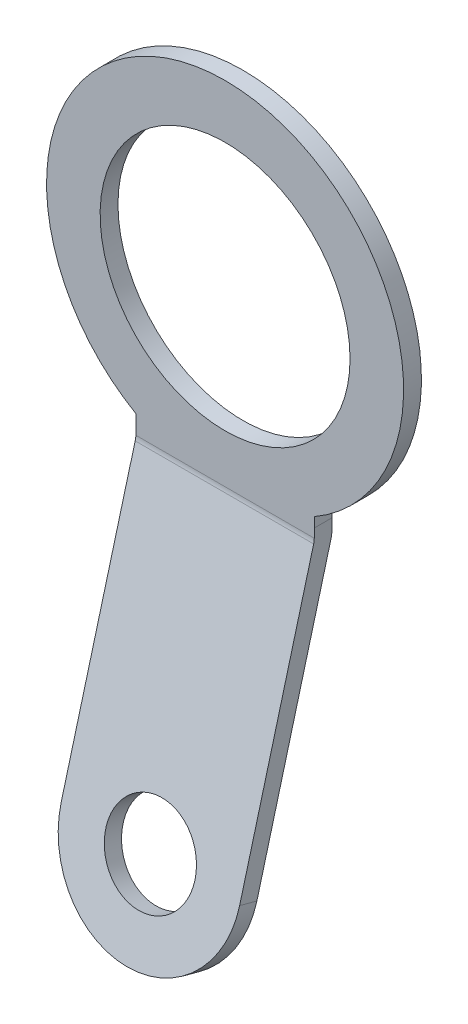
ISO-10303-21;
HEADER;
FILE_DESCRIPTION(('STEP AP214'),'2;1');
FILE_NAME('part.step','',(''),(''),'','','');
FILE_SCHEMA(('AUTOMOTIVE_DESIGN { 1 0 10303 214 1 1 1 1 }'));
ENDSEC;
DATA;
#1=APPLICATION_CONTEXT('core data for automotive mechanical design processes');
#2=APPLICATION_PROTOCOL_DEFINITION('international standard','automotive_design',2000,#1);
#3=PRODUCT_CONTEXT('',#1,'mechanical');
#4=PRODUCT('Part','Part','',(#3));
#5=PRODUCT_RELATED_PRODUCT_CATEGORY('part','',(#4));
#6=PRODUCT_DEFINITION_FORMATION('','',#4);
#7=PRODUCT_DEFINITION_CONTEXT('part definition',#1,'design');
#8=PRODUCT_DEFINITION('design','',#6,#7);
#9=PRODUCT_DEFINITION_SHAPE('','',#8);
#10=(LENGTH_UNIT() NAMED_UNIT(*) SI_UNIT(.MILLI.,.METRE.));
#11=(NAMED_UNIT(*) PLANE_ANGLE_UNIT() SI_UNIT($,.RADIAN.));
#12=(NAMED_UNIT(*) SI_UNIT($,.STERADIAN.) SOLID_ANGLE_UNIT());
#13=UNCERTAINTY_MEASURE_WITH_UNIT(LENGTH_MEASURE(1.E-05),#10,'distance_accuracy_value','');
#14=(GEOMETRIC_REPRESENTATION_CONTEXT(3) GLOBAL_UNCERTAINTY_ASSIGNED_CONTEXT((#13)) GLOBAL_UNIT_ASSIGNED_CONTEXT((#10,
#11,#12)) REPRESENTATION_CONTEXT('',''));
#15=CARTESIAN_POINT('',(0.,0.,0.));
#16=DIRECTION('',(0.,0.,1.));
#17=DIRECTION('',(1.,0.,0.));
#18=AXIS2_PLACEMENT_3D('',#15,#16,#17);
#19=CARTESIAN_POINT('',(0.99918015483103,-1.94233508480034,0.1));
#20=DIRECTION('',(1.,0.,0.));
#21=DIRECTION('',(0.,1.,0.));
#22=AXIS2_PLACEMENT_3D('',#19,#20,#21);
#23=PLANE('',#22);
#24=CARTESIAN_POINT('',(0.99918015483103,-1.94233508480034,0.4));
#25=DIRECTION('',(-1.,0.,0.));
#26=DIRECTION('',(0.,1.,0.));
#27=AXIS2_PLACEMENT_3D('',#24,#25,#26);
#28=CIRCLE('',#27,0.2);
#29=CARTESIAN_POINT('',(0.99918015483103,-1.94233508480034,0.2));
#30=VERTEX_POINT('',#29);
#31=CARTESIAN_POINT('',(0.99918015483103,-1.99409889382085,0.206814834742186));
#32=VERTEX_POINT('',#31);
#33=EDGE_CURVE('E10',#30,#32,#28,.T.);
#34=ORIENTED_EDGE('',*,*,#33,.T.);
#35=DIRECTION('',(0.,-0.965925826289068,0.258819045102521));
#36=VECTOR('',#35,1.);
#37=CARTESIAN_POINT('',(0.999180154831032,-5.08876600205175,1.03602838723581));
#38=LINE('',#37,#36);
#39=CARTESIAN_POINT('',(0.999180154831032,-5.08876600205175,1.03602838723581));
#40=VERTEX_POINT('',#39);
#41=EDGE_CURVE('E130',#32,#40,#38,.T.);
#42=ORIENTED_EDGE('',*,*,#41,.T.);
#43=DIRECTION('',(0.,0.258819045102521,0.965925826289068));
#44=VECTOR('',#43,1.);
#45=CARTESIAN_POINT('',(0.999180154831032,-5.14052981107225,0.842843221977999));
#46=LINE('',#45,#44);
#47=CARTESIAN_POINT('',(0.999180154831032,-5.14052981107225,0.842843221977999));
#48=VERTEX_POINT('',#47);
#49=EDGE_CURVE('E120',#48,#40,#46,.T.);
#50=ORIENTED_EDGE('',*,*,#49,.F.);
#51=DIRECTION('',(0.,0.965925826289068,-0.258819045102521));
#52=VECTOR('',#51,1.);
#53=CARTESIAN_POINT('',(0.999180154831032,-5.14052981107225,0.842843221977999));
#54=LINE('',#53,#52);
#55=CARTESIAN_POINT('',(0.99918015483103,-2.04586270284135,0.0136296694843726));
#56=VERTEX_POINT('',#55);
#57=EDGE_CURVE('E119',#48,#56,#54,.T.);
#58=ORIENTED_EDGE('',*,*,#57,.T.);
#59=CARTESIAN_POINT('',(0.99918015483103,-1.94233508480034,0.4));
#60=DIRECTION('',(-1.,0.,0.));
#61=DIRECTION('',(0.,1.,0.));
#62=AXIS2_PLACEMENT_3D('',#59,#60,#61);
#63=CIRCLE('',#62,0.4);
#64=CARTESIAN_POINT('',(0.99918015483103,-1.94233508480034,0.));
#65=VERTEX_POINT('',#64);
#66=EDGE_CURVE('E26',#65,#56,#63,.T.);
#67=ORIENTED_EDGE('',*,*,#66,.F.);
#68=DIRECTION('',(0.,-1.,0.));
#69=VECTOR('',#68,1.);
#70=CARTESIAN_POINT('',(0.99918015483103,-1.03911021004055,0.));
#71=LINE('',#70,#69);
#72=CARTESIAN_POINT('',(0.99918015483103,-1.84233508480034,0.));
#73=VERTEX_POINT('',#72);
#74=EDGE_CURVE('E194',#73,#65,#71,.T.);
#75=ORIENTED_EDGE('',*,*,#74,.F.);
#76=DIRECTION('',(0.,0.,-1.));
#77=VECTOR('',#76,1.);
#78=CARTESIAN_POINT('',(0.99918015483103,-1.84233508480034,0.2));
#79=LINE('',#78,#77);
#80=CARTESIAN_POINT('',(0.99918015483103,-1.84233508480034,0.2));
#81=VERTEX_POINT('',#80);
#82=EDGE_CURVE('E191',#81,#73,#79,.T.);
#83=ORIENTED_EDGE('',*,*,#82,.F.);
#84=DIRECTION('',(0.,1.,0.));
#85=VECTOR('',#84,1.);
#86=CARTESIAN_POINT('',(0.99918015483103,-1.03911021004055,0.2));
#87=LINE('',#86,#85);
#88=EDGE_CURVE('E162',#30,#81,#87,.T.);
#89=ORIENTED_EDGE('',*,*,#88,.F.);
#90=EDGE_LOOP('',(#34,#42,#50,#58,#67,#75,#83,#89));
#91=FACE_BOUND('',#90,.T.);
#92=ADVANCED_FACE('F16',(#91),#23,.T.);
#93=CARTESIAN_POINT('',(-0.000409922584484745,-1.94233508480034,0.4));
#94=DIRECTION('',(-1.,0.,0.));
#95=DIRECTION('',(0.,1.,0.));
#96=AXIS2_PLACEMENT_3D('',#93,#94,#95);
#97=CYLINDRICAL_SURFACE('',#96,0.4);
#98=DIRECTION('',(1.,0.,0.));
#99=VECTOR('',#98,1.);
#100=CARTESIAN_POINT('',(0.999180154831031,-2.04586270284135,0.0136296694843725));
#101=LINE('',#100,#99);
#102=CARTESIAN_POINT('',(-1.,-2.04586270284135,0.0136296694843726));
#103=VERTEX_POINT('',#102);
#104=EDGE_CURVE('E35',#103,#56,#101,.T.);
#105=ORIENTED_EDGE('',*,*,#104,.F.);
#106=CARTESIAN_POINT('',(-1.,-1.94233508480034,0.4));
#107=DIRECTION('',(-1.,0.,0.));
#108=DIRECTION('',(0.,1.,0.));
#109=AXIS2_PLACEMENT_3D('',#106,#107,#108);
#110=CIRCLE('',#109,0.4);
#111=CARTESIAN_POINT('',(-1.,-1.94233508480034,0.));
#112=VERTEX_POINT('',#111);
#113=EDGE_CURVE('E205',#112,#103,#110,.T.);
#114=ORIENTED_EDGE('',*,*,#113,.F.);
#115=DIRECTION('',(-1.,0.,0.));
#116=VECTOR('',#115,1.);
#117=CARTESIAN_POINT('',(-0.5,-1.94233508480034,0.));
#118=LINE('',#117,#116);
#119=EDGE_CURVE('E169',#65,#112,#118,.T.);
#120=ORIENTED_EDGE('',*,*,#119,.F.);
#121=ORIENTED_EDGE('',*,*,#66,.T.);
#122=EDGE_LOOP('',(#105,#114,#120,#121));
#123=FACE_BOUND('',#122,.T.);
#124=ADVANCED_FACE('F212',(#123),#97,.T.);
#125=CARTESIAN_POINT('',(-1.,-1.94233508480034,0.1));
#126=DIRECTION('',(-1.,0.,0.));
#127=DIRECTION('',(0.,-1.,0.));
#128=AXIS2_PLACEMENT_3D('',#125,#126,#127);
#129=PLANE('',#128);
#130=ORIENTED_EDGE('',*,*,#113,.T.);
#131=DIRECTION('',(0.,0.965925826289068,-0.258819045102521));
#132=VECTOR('',#131,1.);
#133=CARTESIAN_POINT('',(-1.,-2.23791892034897,0.0650909778669154));
#134=LINE('',#133,#132);
#135=CARTESIAN_POINT('',(-1.,-2.23791892034897,0.0650909778669154));
#136=VERTEX_POINT('',#135);
#137=EDGE_CURVE('E143',#136,#103,#134,.T.);
#138=ORIENTED_EDGE('',*,*,#137,.F.);
#139=DIRECTION('',(0.,-0.258819045102521,-0.965925826289068));
#140=VECTOR('',#139,1.);
#141=CARTESIAN_POINT('',(-1.,-2.21203701583872,0.161683560495822));
#142=LINE('',#141,#140);
#143=CARTESIAN_POINT('',(-1.,-2.18615511132847,0.258276143124729));
#144=VERTEX_POINT('',#143);
#145=EDGE_CURVE('E140',#144,#136,#142,.T.);
#146=ORIENTED_EDGE('',*,*,#145,.F.);
#147=DIRECTION('',(0.,0.965925826289068,-0.258819045102521));
#148=VECTOR('',#147,1.);
#149=CARTESIAN_POINT('',(-1.,-2.18615511132847,0.258276143124729));
#150=LINE('',#149,#148);
#151=CARTESIAN_POINT('',(-1.,-1.99409889382085,0.206814834742186));
#152=VERTEX_POINT('',#151);
#153=EDGE_CURVE('E148',#144,#152,#150,.T.);
#154=ORIENTED_EDGE('',*,*,#153,.T.);
#155=CARTESIAN_POINT('',(-1.,-1.94233508480034,0.4));
#156=DIRECTION('',(-1.,0.,0.));
#157=DIRECTION('',(0.,1.,0.));
#158=AXIS2_PLACEMENT_3D('',#155,#156,#157);
#159=CIRCLE('',#158,0.2);
#160=CARTESIAN_POINT('',(-1.,-1.94233508480034,0.2));
#161=VERTEX_POINT('',#160);
#162=EDGE_CURVE('E198',#161,#152,#159,.T.);
#163=ORIENTED_EDGE('',*,*,#162,.F.);
#164=DIRECTION('',(0.,1.,0.));
#165=VECTOR('',#164,1.);
#166=CARTESIAN_POINT('',(-1.,-1.73205080756888,0.2));
#167=LINE('',#166,#165);
#168=CARTESIAN_POINT('',(-1.,-1.73205080756888,0.2));
#169=VERTEX_POINT('',#168);
#170=EDGE_CURVE('E166',#161,#169,#167,.T.);
#171=ORIENTED_EDGE('',*,*,#170,.T.);
#172=DIRECTION('',(0.,0.,1.));
#173=VECTOR('',#172,1.);
#174=CARTESIAN_POINT('',(-1.,-1.73205080756888,0.));
#175=LINE('',#174,#173);
#176=CARTESIAN_POINT('',(-1.,-1.73205080756888,0.));
#177=VERTEX_POINT('',#176);
#178=EDGE_CURVE('E163',#177,#169,#175,.T.);
#179=ORIENTED_EDGE('',*,*,#178,.F.);
#180=DIRECTION('',(0.,-1.,0.));
#181=VECTOR('',#180,1.);
#182=CARTESIAN_POINT('',(-1.,-1.73205080756888,0.));
#183=LINE('',#182,#181);
#184=EDGE_CURVE('E158',#177,#112,#183,.T.);
#185=ORIENTED_EDGE('',*,*,#184,.T.);
#186=EDGE_LOOP('',(#130,#138,#146,#154,#163,#171,#179,#185));
#187=FACE_BOUND('',#186,.T.);
#188=ADVANCED_FACE('F224',(#187),#129,.T.);
#189=CARTESIAN_POINT('',(-0.000409922584484745,-1.94233508480034,0.4));
#190=DIRECTION('',(-1.,0.,0.));
#191=DIRECTION('',(0.,1.,0.));
#192=AXIS2_PLACEMENT_3D('',#189,#190,#191);
#193=CYLINDRICAL_SURFACE('',#192,0.2);
#194=DIRECTION('',(-1.,0.,0.));
#195=VECTOR('',#194,1.);
#196=CARTESIAN_POINT('',(-1.,-1.99409889382085,0.206814834742186));
#197=LINE('',#196,#195);
#198=EDGE_CURVE('E147',#32,#152,#197,.T.);
#199=ORIENTED_EDGE('',*,*,#198,.F.);
#200=ORIENTED_EDGE('',*,*,#33,.F.);
#201=DIRECTION('',(1.,0.,0.));
#202=VECTOR('',#201,1.);
#203=CARTESIAN_POINT('',(-0.5,-1.94233508480034,0.2));
#204=LINE('',#203,#202);
#205=EDGE_CURVE('E188',#161,#30,#204,.T.);
#206=ORIENTED_EDGE('',*,*,#205,.F.);
#207=ORIENTED_EDGE('',*,*,#162,.T.);
#208=EDGE_LOOP('',(#199,#200,#206,#207));
#209=FACE_BOUND('',#208,.T.);
#210=ADVANCED_FACE('F243',(#209),#193,.F.);
#211=CARTESIAN_POINT('',(1.,-1.84233508480034,0.2));
#212=DIRECTION('',(0.,1.,0.));
#213=DIRECTION('',(0.,0.,1.));
#214=AXIS2_PLACEMENT_3D('',#211,#212,#213);
#215=PLANE('',#214);
#216=DIRECTION('',(-1.,0.,0.));
#217=VECTOR('',#216,1.);
#218=CARTESIAN_POINT('',(0.5,-1.84233508480034,0.));
#219=LINE('',#218,#217);
#220=CARTESIAN_POINT('',(1.,-1.84233508480034,0.));
#221=VERTEX_POINT('',#220);
#222=EDGE_CURVE('E177',#221,#73,#219,.T.);
#223=ORIENTED_EDGE('',*,*,#222,.F.);
#224=DIRECTION('',(0.,0.,-1.));
#225=VECTOR('',#224,1.);
#226=CARTESIAN_POINT('',(1.,-1.84233508480034,0.1));
#227=LINE('',#226,#225);
#228=CARTESIAN_POINT('',(1.,-1.84233508480034,0.2));
#229=VERTEX_POINT('',#228);
#230=EDGE_CURVE('E186',#229,#221,#227,.T.);
#231=ORIENTED_EDGE('',*,*,#230,.F.);
#232=DIRECTION('',(1.,0.,0.));
#233=VECTOR('',#232,1.);
#234=CARTESIAN_POINT('',(0.5,-1.84233508480034,0.2));
#235=LINE('',#234,#233);
#236=EDGE_CURVE('E165',#81,#229,#235,.T.);
#237=ORIENTED_EDGE('',*,*,#236,.F.);
#238=ORIENTED_EDGE('',*,*,#82,.T.);
#239=EDGE_LOOP('',(#223,#231,#237,#238));
#240=FACE_BOUND('',#239,.T.);
#241=ADVANCED_FACE('F234',(#240),#215,.F.);
#242=CARTESIAN_POINT('',(1.,-1.73205080756888,0.));
#243=DIRECTION('',(1.,0.,0.));
#244=DIRECTION('',(0.,1.,0.));
#245=AXIS2_PLACEMENT_3D('',#242,#243,#244);
#246=PLANE('',#245);
#247=ORIENTED_EDGE('',*,*,#230,.T.);
#248=DIRECTION('',(0.,1.,0.));
#249=VECTOR('',#248,1.);
#250=CARTESIAN_POINT('',(1.,-5.,0.));
#251=LINE('',#250,#249);
#252=CARTESIAN_POINT('',(1.,-1.73205080756888,0.));
#253=VERTEX_POINT('',#252);
#254=EDGE_CURVE('E183',#221,#253,#251,.T.);
#255=ORIENTED_EDGE('',*,*,#254,.T.);
#256=DIRECTION('',(0.,0.,1.));
#257=VECTOR('',#256,1.);
#258=CARTESIAN_POINT('',(1.,-1.73205080756888,0.));
#259=LINE('',#258,#257);
#260=CARTESIAN_POINT('',(1.,-1.73205080756888,0.2));
#261=VERTEX_POINT('',#260);
#262=EDGE_CURVE('E180',#253,#261,#259,.T.);
#263=ORIENTED_EDGE('',*,*,#262,.T.);
#264=DIRECTION('',(0.,-1.,0.));
#265=VECTOR('',#264,1.);
#266=CARTESIAN_POINT('',(1.,-5.,0.2));
#267=LINE('',#266,#265);
#268=EDGE_CURVE('E176',#261,#229,#267,.T.);
#269=ORIENTED_EDGE('',*,*,#268,.T.);
#270=EDGE_LOOP('',(#247,#255,#263,#269));
#271=FACE_BOUND('',#270,.T.);
#272=ADVANCED_FACE('F247',(#271),#246,.T.);
#273=CARTESIAN_POINT('',(0.,-0.235885335280752,0.));
#274=DIRECTION('',(0.,0.,1.));
#275=DIRECTION('',(1.,0.,0.));
#276=AXIS2_PLACEMENT_3D('',#273,#274,#275);
#277=PLANE('',#276);
#278=CARTESIAN_POINT('',(0.,0.,0.));
#279=DIRECTION('',(0.,0.,1.));
#280=DIRECTION('',(1.,0.,0.));
#281=AXIS2_PLACEMENT_3D('',#278,#279,#280);
#282=CIRCLE('',#281,1.4);
#283=CARTESIAN_POINT('',(1.4,0.,0.));
#284=VERTEX_POINT('',#283);
#285=EDGE_CURVE('E173',#284,#284,#282,.T.);
#286=ORIENTED_EDGE('',*,*,#285,.T.);
#287=EDGE_LOOP('',(#286));
#288=FACE_BOUND('',#287,.T.);
#289=ORIENTED_EDGE('',*,*,#222,.T.);
#290=ORIENTED_EDGE('',*,*,#74,.T.);
#291=ORIENTED_EDGE('',*,*,#119,.T.);
#292=ORIENTED_EDGE('',*,*,#184,.F.);
#293=CARTESIAN_POINT('',(0.,0.,0.));
#294=DIRECTION('',(0.,0.,1.));
#295=DIRECTION('',(1.,0.,0.));
#296=AXIS2_PLACEMENT_3D('',#293,#294,#295);
#297=CIRCLE('',#296,2.);
#298=EDGE_CURVE('E159',#253,#177,#297,.T.);
#299=ORIENTED_EDGE('',*,*,#298,.F.);
#300=ORIENTED_EDGE('',*,*,#254,.F.);
#301=EDGE_LOOP('',(#289,#290,#291,#292,#299,#300));
#302=FACE_BOUND('',#301,.T.);
#303=ADVANCED_FACE('F229',(#288,#302),#277,.F.);
#304=CARTESIAN_POINT('',(0.,0.,0.));
#305=DIRECTION('',(0.,0.,1.));
#306=DIRECTION('',(1.,0.,0.));
#307=AXIS2_PLACEMENT_3D('',#304,#305,#306);
#308=CYLINDRICAL_SURFACE('',#307,1.4);
#309=CARTESIAN_POINT('',(0.,0.,0.2));
#310=DIRECTION('',(0.,0.,-1.));
#311=DIRECTION('',(0.,-1.,0.));
#312=AXIS2_PLACEMENT_3D('',#309,#310,#311);
#313=CIRCLE('',#312,1.4);
#314=CARTESIAN_POINT('',(0.,-1.4,0.2));
#315=VERTEX_POINT('',#314);
#316=EDGE_CURVE('E151',#315,#315,#313,.T.);
#317=ORIENTED_EDGE('',*,*,#316,.F.);
#318=EDGE_LOOP('',(#317));
#319=FACE_BOUND('',#318,.T.);
#320=ORIENTED_EDGE('',*,*,#285,.F.);
#321=EDGE_LOOP('',(#320));
#322=FACE_BOUND('',#321,.T.);
#323=ADVANCED_FACE('F255',(#319,#322),#308,.F.);
#324=CARTESIAN_POINT('',(0.,0.,0.));
#325=DIRECTION('',(0.,0.,1.));
#326=DIRECTION('',(1.,0.,0.));
#327=AXIS2_PLACEMENT_3D('',#324,#325,#326);
#328=CYLINDRICAL_SURFACE('',#327,2.);
#329=CARTESIAN_POINT('',(0.,0.,0.2));
#330=DIRECTION('',(0.,0.,-1.));
#331=DIRECTION('',(0.,-1.,0.));
#332=AXIS2_PLACEMENT_3D('',#329,#330,#331);
#333=CIRCLE('',#332,2.);
#334=EDGE_CURVE('E155',#169,#261,#333,.T.);
#335=ORIENTED_EDGE('',*,*,#334,.T.);
#336=ORIENTED_EDGE('',*,*,#262,.F.);
#337=ORIENTED_EDGE('',*,*,#298,.T.);
#338=ORIENTED_EDGE('',*,*,#178,.T.);
#339=EDGE_LOOP('',(#335,#336,#337,#338));
#340=FACE_BOUND('',#339,.T.);
#341=ADVANCED_FACE('F245',(#340),#328,.T.);
#342=CARTESIAN_POINT('',(0.,-0.235885335280752,0.2));
#343=DIRECTION('',(0.,0.,1.));
#344=DIRECTION('',(1.,0.,0.));
#345=AXIS2_PLACEMENT_3D('',#342,#343,#344);
#346=PLANE('',#345);
#347=ORIENTED_EDGE('',*,*,#236,.T.);
#348=ORIENTED_EDGE('',*,*,#268,.F.);
#349=ORIENTED_EDGE('',*,*,#334,.F.);
#350=ORIENTED_EDGE('',*,*,#170,.F.);
#351=ORIENTED_EDGE('',*,*,#205,.T.);
#352=ORIENTED_EDGE('',*,*,#88,.T.);
#353=EDGE_LOOP('',(#347,#348,#349,#350,#351,#352));
#354=FACE_BOUND('',#353,.T.);
#355=ORIENTED_EDGE('',*,*,#316,.T.);
#356=EDGE_LOOP('',(#355));
#357=FACE_BOUND('',#356,.T.);
#358=ADVANCED_FACE('F237',(#354,#357),#346,.T.);
#359=CARTESIAN_POINT('',(-0.000819845168967548,-5.14052981107225,0.842843221977999));
#360=DIRECTION('',(0.,0.258819045102521,0.965925826289068));
#361=DIRECTION('',(1.,0.,0.));
#362=AXIS2_PLACEMENT_3D('',#359,#360,#361);
#363=CYLINDRICAL_SURFACE('',#362,0.5);
#364=CARTESIAN_POINT('',(-0.000819845168967548,-5.08876600205175,1.03602838723581));
#365=DIRECTION('',(0.,-0.258819045102521,-0.965925826289068));
#366=DIRECTION('',(0.,-0.965925826289068,0.258819045102521));
#367=AXIS2_PLACEMENT_3D('',#364,#365,#366);
#368=CIRCLE('',#367,0.5);
#369=CARTESIAN_POINT('',(-0.000819845168967548,-5.57172891519628,1.16543790978707));
#370=VERTEX_POINT('',#369);
#371=EDGE_CURVE('E144',#370,#370,#368,.T.);
#372=ORIENTED_EDGE('',*,*,#371,.F.);
#373=EDGE_LOOP('',(#372));
#374=FACE_BOUND('',#373,.T.);
#375=CARTESIAN_POINT('',(-0.000819845168967548,-5.14052981107225,0.842843221977999));
#376=DIRECTION('',(0.,0.258819045102521,0.965925826289068));
#377=DIRECTION('',(1.,0.,0.));
#378=AXIS2_PLACEMENT_3D('',#375,#376,#377);
#379=CIRCLE('',#378,0.5);
#380=CARTESIAN_POINT('',(0.499180154831032,-5.14052981107225,0.842843221977999));
#381=VERTEX_POINT('',#380);
#382=EDGE_CURVE('E113',#381,#381,#379,.T.);
#383=ORIENTED_EDGE('',*,*,#382,.F.);
#384=EDGE_LOOP('',(#383));
#385=FACE_BOUND('',#384,.T.);
#386=ADVANCED_FACE('F279',(#374,#385),#363,.F.);
#387=CARTESIAN_POINT('',(-1.00081984516897,-2.23791892034897,0.0650909778669154));
#388=DIRECTION('',(0.,0.965925826289068,-0.258819045102521));
#389=DIRECTION('',(0.,0.258819045102521,0.965925826289068));
#390=AXIS2_PLACEMENT_3D('',#387,#388,#389);
#391=PLANE('',#390);
#392=ORIENTED_EDGE('',*,*,#145,.T.);
#393=DIRECTION('',(-1.,0.,0.));
#394=VECTOR('',#393,1.);
#395=CARTESIAN_POINT('',(0.99918015483103,-2.23791892034897,0.0650909778669154));
#396=LINE('',#395,#394);
#397=CARTESIAN_POINT('',(-1.00081984516897,-2.23791892034897,0.0650909778669154));
#398=VERTEX_POINT('',#397);
#399=EDGE_CURVE('E138',#136,#398,#396,.T.);
#400=ORIENTED_EDGE('',*,*,#399,.T.);
#401=DIRECTION('',(0.,0.258819045102521,0.965925826289068));
#402=VECTOR('',#401,1.);
#403=CARTESIAN_POINT('',(-1.00081984516897,-2.23791892034897,0.0650909778669154));
#404=LINE('',#403,#402);
#405=CARTESIAN_POINT('',(-1.00081984516897,-2.18615511132847,0.258276143124729));
#406=VERTEX_POINT('',#405);
#407=EDGE_CURVE('E124',#398,#406,#404,.T.);
#408=ORIENTED_EDGE('',*,*,#407,.T.);
#409=DIRECTION('',(1.,0.,0.));
#410=VECTOR('',#409,1.);
#411=CARTESIAN_POINT('',(0.99918015483103,-2.18615511132847,0.258276143124729));
#412=LINE('',#411,#410);
#413=EDGE_CURVE('E134',#406,#144,#412,.T.);
#414=ORIENTED_EDGE('',*,*,#413,.T.);
#415=EDGE_LOOP('',(#392,#400,#408,#414));
#416=FACE_BOUND('',#415,.T.);
#417=ADVANCED_FACE('F222',(#416),#391,.T.);
#418=CARTESIAN_POINT('',(-0.000819845168967548,-5.14052981107225,0.842843221977999));
#419=DIRECTION('',(0.,0.258819045102521,0.965925826289068));
#420=DIRECTION('',(1.,0.,0.));
#421=AXIS2_PLACEMENT_3D('',#418,#419,#420);
#422=CYLINDRICAL_SURFACE('',#421,1.);
#423=CARTESIAN_POINT('',(-0.000819845168967548,-5.08876600205175,1.03602838723581));
#424=DIRECTION('',(0.,-0.258819045102521,-0.965925826289068));
#425=DIRECTION('',(0.,-0.965925826289068,0.258819045102521));
#426=AXIS2_PLACEMENT_3D('',#423,#424,#425);
#427=CIRCLE('',#426,1.);
#428=CARTESIAN_POINT('',(-1.00081984516897,-5.08876600205175,1.03602838723581));
#429=VERTEX_POINT('',#428);
#430=EDGE_CURVE('E111',#40,#429,#427,.T.);
#431=ORIENTED_EDGE('',*,*,#430,.T.);
#432=DIRECTION('',(0.,0.258819045102521,0.965925826289068));
#433=VECTOR('',#432,1.);
#434=CARTESIAN_POINT('',(-1.00081984516897,-5.14052981107225,0.842843221977999));
#435=LINE('',#434,#433);
#436=CARTESIAN_POINT('',(-1.00081984516897,-5.14052981107225,0.842843221977999));
#437=VERTEX_POINT('',#436);
#438=EDGE_CURVE('E104',#437,#429,#435,.T.);
#439=ORIENTED_EDGE('',*,*,#438,.F.);
#440=CARTESIAN_POINT('',(-0.000819845168967548,-5.14052981107225,0.842843221977999));
#441=DIRECTION('',(0.,0.258819045102521,0.965925826289068));
#442=DIRECTION('',(1.,0.,0.));
#443=AXIS2_PLACEMENT_3D('',#440,#441,#442);
#444=CIRCLE('',#443,1.);
#445=EDGE_CURVE('E109',#437,#48,#444,.T.);
#446=ORIENTED_EDGE('',*,*,#445,.T.);
#447=ORIENTED_EDGE('',*,*,#49,.T.);
#448=EDGE_LOOP('',(#431,#439,#446,#447));
#449=FACE_BOUND('',#448,.T.);
#450=ADVANCED_FACE('F18',(#449),#422,.T.);
#451=CARTESIAN_POINT('',(-1.00081984516897,-5.14052981107225,0.842843221977999));
#452=DIRECTION('',(-1.,0.,0.));
#453=DIRECTION('',(0.,-1.,0.));
#454=AXIS2_PLACEMENT_3D('',#451,#452,#453);
#455=PLANE('',#454);
#456=DIRECTION('',(0.,0.965925826289068,-0.258819045102521));
#457=VECTOR('',#456,1.);
#458=CARTESIAN_POINT('',(-1.00081984516897,-2.18615511132847,0.258276143124729));
#459=LINE('',#458,#457);
#460=EDGE_CURVE('E126',#429,#406,#459,.T.);
#461=ORIENTED_EDGE('',*,*,#460,.T.);
#462=ORIENTED_EDGE('',*,*,#407,.F.);
#463=DIRECTION('',(0.,-0.965925826289068,0.258819045102521));
#464=VECTOR('',#463,1.);
#465=CARTESIAN_POINT('',(-1.00081984516897,-2.23791892034897,0.0650909778669155));
#466=LINE('',#465,#464);
#467=EDGE_CURVE('E20',#398,#437,#466,.T.);
#468=ORIENTED_EDGE('',*,*,#467,.T.);
#469=ORIENTED_EDGE('',*,*,#438,.T.);
#470=EDGE_LOOP('',(#461,#462,#468,#469));
#471=FACE_BOUND('',#470,.T.);
#472=ADVANCED_FACE('F122',(#471),#455,.T.);
#473=CARTESIAN_POINT('',(-0.000819845168968296,-3.99398422463251,0.535627258006003));
#474=DIRECTION('',(0.,0.258819045102521,0.965925826289068));
#475=DIRECTION('',(0.,-0.965925826289068,0.258819045102521));
#476=AXIS2_PLACEMENT_3D('',#473,#474,#475);
#477=PLANE('',#476);
#478=ORIENTED_EDGE('',*,*,#382,.T.);
#479=EDGE_LOOP('',(#478));
#480=FACE_BOUND('',#479,.T.);
#481=ORIENTED_EDGE('',*,*,#467,.F.);
#482=ORIENTED_EDGE('',*,*,#399,.F.);
#483=ORIENTED_EDGE('',*,*,#137,.T.);
#484=ORIENTED_EDGE('',*,*,#104,.T.);
#485=ORIENTED_EDGE('',*,*,#57,.F.);
#486=ORIENTED_EDGE('',*,*,#445,.F.);
#487=EDGE_LOOP('',(#481,#482,#483,#484,#485,#486));
#488=FACE_BOUND('',#487,.T.);
#489=ADVANCED_FACE('F116',(#480,#488),#477,.F.);
#490=CARTESIAN_POINT('',(-0.000819845168968297,-3.942220415612,0.728812423263816));
#491=DIRECTION('',(0.,0.258819045102521,0.965925826289068));
#492=DIRECTION('',(0.,-0.965925826289068,0.258819045102521));
#493=AXIS2_PLACEMENT_3D('',#490,#491,#492);
#494=PLANE('',#493);
#495=ORIENTED_EDGE('',*,*,#371,.T.);
#496=EDGE_LOOP('',(#495));
#497=FACE_BOUND('',#496,.T.);
#498=ORIENTED_EDGE('',*,*,#413,.F.);
#499=ORIENTED_EDGE('',*,*,#460,.F.);
#500=ORIENTED_EDGE('',*,*,#430,.F.);
#501=ORIENTED_EDGE('',*,*,#41,.F.);
#502=ORIENTED_EDGE('',*,*,#198,.T.);
#503=ORIENTED_EDGE('',*,*,#153,.F.);
#504=EDGE_LOOP('',(#498,#499,#500,#501,#502,#503));
#505=FACE_BOUND('',#504,.T.);
#506=ADVANCED_FACE('F219',(#497,#505),#494,.T.);
#507=CLOSED_SHELL('',(#92,#124,#188,#210,#241,#272,#303,#323,#341,#358,#386,#417,#450,#472,#489,#506));
#508=MANIFOLD_SOLID_BREP('B1',#507);
#509=ADVANCED_BREP_SHAPE_REPRESENTATION('',(#18,#508),#14);
#510=SHAPE_DEFINITION_REPRESENTATION(#9,#509);
ENDSEC;
END-ISO-10303-21;
